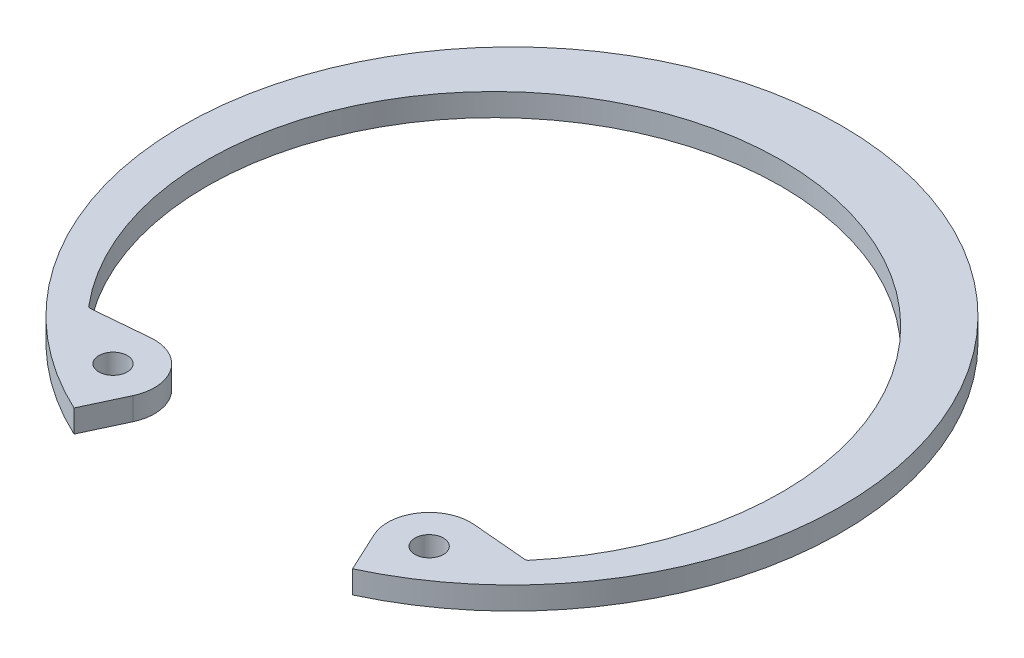
ISO-10303-21;
HEADER;
FILE_DESCRIPTION(('STEP AP214'),'2;1');
FILE_NAME('part.step','',(''),(''),'','','');
FILE_SCHEMA(('AUTOMOTIVE_DESIGN { 1 0 10303 214 1 1 1 1 }'));
ENDSEC;
DATA;
#1=APPLICATION_CONTEXT('core data for automotive mechanical design processes');
#2=APPLICATION_PROTOCOL_DEFINITION('international standard','automotive_design',2000,#1);
#3=PRODUCT_CONTEXT('',#1,'mechanical');
#4=PRODUCT('Part','Part','',(#3));
#5=PRODUCT_RELATED_PRODUCT_CATEGORY('part','',(#4));
#6=PRODUCT_DEFINITION_FORMATION('','',#4);
#7=PRODUCT_DEFINITION_CONTEXT('part definition',#1,'design');
#8=PRODUCT_DEFINITION('design','',#6,#7);
#9=PRODUCT_DEFINITION_SHAPE('','',#8);
#10=(LENGTH_UNIT() NAMED_UNIT(*) SI_UNIT(.MILLI.,.METRE.));
#11=(NAMED_UNIT(*) PLANE_ANGLE_UNIT() SI_UNIT($,.RADIAN.));
#12=(NAMED_UNIT(*) SI_UNIT($,.STERADIAN.) SOLID_ANGLE_UNIT());
#13=UNCERTAINTY_MEASURE_WITH_UNIT(LENGTH_MEASURE(1.E-05),#10,'distance_accuracy_value','');
#14=(GEOMETRIC_REPRESENTATION_CONTEXT(3) GLOBAL_UNCERTAINTY_ASSIGNED_CONTEXT((#13)) GLOBAL_UNIT_ASSIGNED_CONTEXT((#10,
#11,#12)) REPRESENTATION_CONTEXT('',''));
#15=CARTESIAN_POINT('',(0.,0.,0.));
#16=DIRECTION('',(0.,0.,1.));
#17=DIRECTION('',(1.,0.,0.));
#18=AXIS2_PLACEMENT_3D('',#15,#16,#17);
#19=CARTESIAN_POINT('',(10.9888036399848,-1.5748,16.744042909998));
#20=DIRECTION('',(0.,1.,0.));
#21=DIRECTION('',(0.,0.,1.));
#22=AXIS2_PLACEMENT_3D('',#19,#20,#21);
#23=CYLINDRICAL_SURFACE('',#22,2.8829);
#24=CARTESIAN_POINT('',(10.9888036399848,0.,16.744042909998));
#25=DIRECTION('',(0.,1.,0.));
#26=DIRECTION('',(0.,0.,-1.));
#27=AXIS2_PLACEMENT_3D('',#24,#25,#26);
#28=CIRCLE('',#27,2.8829);
#29=CARTESIAN_POINT('',(11.2400649307521,0.,13.8721132148694));
#30=VERTEX_POINT('',#29);
#31=CARTESIAN_POINT('',(8.37600892073687,0.,17.9624090967703));
#32=VERTEX_POINT('',#31);
#33=EDGE_CURVE('E156',#30,#32,#28,.T.);
#34=ORIENTED_EDGE('',*,*,#33,.F.);
#35=DIRECTION('',(0.,1.,0.));
#36=VECTOR('',#35,1.);
#37=CARTESIAN_POINT('',(11.2400649307521,-1.5748,13.8721132148694));
#38=LINE('',#37,#36);
#39=CARTESIAN_POINT('',(11.2400649307521,-1.5748,13.8721132148694));
#40=VERTEX_POINT('',#39);
#41=EDGE_CURVE('E133',#40,#30,#38,.T.);
#42=ORIENTED_EDGE('',*,*,#41,.F.);
#43=CARTESIAN_POINT('',(10.9888036399848,-1.5748,16.744042909998));
#44=DIRECTION('',(0.,1.,0.));
#45=DIRECTION('',(0.,0.,-1.));
#46=AXIS2_PLACEMENT_3D('',#43,#44,#45);
#47=CIRCLE('',#46,2.8829);
#48=CARTESIAN_POINT('',(8.37600892073687,-1.5748,17.9624090967703));
#49=VERTEX_POINT('',#48);
#50=EDGE_CURVE('E126',#40,#49,#47,.T.);
#51=ORIENTED_EDGE('',*,*,#50,.T.);
#52=DIRECTION('',(0.,1.,0.));
#53=VECTOR('',#52,1.);
#54=CARTESIAN_POINT('',(8.37600892073687,-1.5748,17.9624090967703));
#55=LINE('',#54,#53);
#56=EDGE_CURVE('E109',#49,#32,#55,.T.);
#57=ORIENTED_EDGE('',*,*,#56,.T.);
#58=EDGE_LOOP('',(#34,#42,#51,#57));
#59=FACE_BOUND('',#58,.T.);
#60=ADVANCED_FACE('F34',(#59),#23,.T.);
#61=CARTESIAN_POINT('',(15.2181746807127,-1.5748,14.2201527202529));
#62=DIRECTION('',(0.0871557427476615,0.,-0.996194698091745));
#63=DIRECTION('',(-0.996194698091745,0.,-0.0871557427476615));
#64=AXIS2_PLACEMENT_3D('',#61,#62,#63);
#65=PLANE('',#64);
#66=DIRECTION('',(-0.996194698091745,0.,-0.0871557427476615));
#67=VECTOR('',#66,1.);
#68=CARTESIAN_POINT('',(15.2181746807127,0.,14.2201527202529));
#69=LINE('',#68,#67);
#70=CARTESIAN_POINT('',(15.0871573079693,0.,14.2086901854129));
#71=VERTEX_POINT('',#70);
#72=EDGE_CURVE('E134',#71,#30,#69,.T.);
#73=ORIENTED_EDGE('',*,*,#72,.F.);
#74=DIRECTION('',(0.,-1.,0.));
#75=VECTOR('',#74,1.);
#76=CARTESIAN_POINT('',(15.0871573079693,-1.5748,14.2086901854129));
#77=LINE('',#76,#75);
#78=CARTESIAN_POINT('',(15.0871573079693,-1.5748,14.2086901854129));
#79=VERTEX_POINT('',#78);
#80=EDGE_CURVE('E49',#71,#79,#77,.T.);
#81=ORIENTED_EDGE('',*,*,#80,.T.);
#82=DIRECTION('',(-0.996194698091745,0.,-0.0871557427476615));
#83=VECTOR('',#82,1.);
#84=CARTESIAN_POINT('',(15.2181746807127,-1.5748,14.2201527202529));
#85=LINE('',#84,#83);
#86=EDGE_CURVE('E120',#79,#40,#85,.T.);
#87=ORIENTED_EDGE('',*,*,#86,.T.);
#88=ORIENTED_EDGE('',*,*,#41,.T.);
#89=EDGE_LOOP('',(#73,#81,#87,#88));
#90=FACE_BOUND('',#89,.T.);
#91=ADVANCED_FACE('F211',(#90),#65,.T.);
#92=CARTESIAN_POINT('',(0.,-1.5748,1.25014680806619));
#93=DIRECTION('',(0.,1.,0.));
#94=DIRECTION('',(0.,0.,1.));
#95=AXIS2_PLACEMENT_3D('',#92,#93,#94);
#96=CYLINDRICAL_SURFACE('',#95,19.9953468080662);
#97=CARTESIAN_POINT('',(0.,0.,1.25014680806619));
#98=DIRECTION('',(0.,-1.,0.));
#99=DIRECTION('',(0.,0.,1.));
#100=AXIS2_PLACEMENT_3D('',#97,#98,#99);
#101=CIRCLE('',#100,19.9953468080662);
#102=CARTESIAN_POINT('',(-15.3036970486786,0.,14.1191308634261));
#103=VERTEX_POINT('',#102);
#104=CARTESIAN_POINT('',(15.3036970486787,0.,14.1191308634261));
#105=VERTEX_POINT('',#104);
#106=EDGE_CURVE('E136',#103,#105,#101,.T.);
#107=ORIENTED_EDGE('',*,*,#106,.F.);
#108=DIRECTION('',(0.,1.,0.));
#109=VECTOR('',#108,1.);
#110=CARTESIAN_POINT('',(-15.3036970486786,-1.5748,14.1191308634261));
#111=LINE('',#110,#109);
#112=CARTESIAN_POINT('',(-15.3036970486786,-1.5748,14.1191308634261));
#113=VERTEX_POINT('',#112);
#114=EDGE_CURVE('E187',#103,#113,#111,.F.);
#115=ORIENTED_EDGE('',*,*,#114,.T.);
#116=CARTESIAN_POINT('',(0.,-1.5748,1.25014680806619));
#117=DIRECTION('',(0.,-1.,0.));
#118=DIRECTION('',(0.,0.,1.));
#119=AXIS2_PLACEMENT_3D('',#116,#117,#118);
#120=CIRCLE('',#119,19.9953468080662);
#121=CARTESIAN_POINT('',(15.3036970486787,-1.5748,14.1191308634261));
#122=VERTEX_POINT('',#121);
#123=EDGE_CURVE('E152',#113,#122,#120,.T.);
#124=ORIENTED_EDGE('',*,*,#123,.T.);
#125=DIRECTION('',(0.,1.,0.));
#126=VECTOR('',#125,1.);
#127=CARTESIAN_POINT('',(15.3036970486787,-1.5748,14.1191308634261));
#128=LINE('',#127,#126);
#129=EDGE_CURVE('E184',#122,#105,#128,.T.);
#130=ORIENTED_EDGE('',*,*,#129,.T.);
#131=EDGE_LOOP('',(#107,#115,#124,#130));
#132=FACE_BOUND('',#131,.T.);
#133=ADVANCED_FACE('F207',(#132),#96,.F.);
#134=CARTESIAN_POINT('',(-15.2181746807127,-1.5748,14.2201527202528));
#135=DIRECTION('',(-0.0871557427476554,0.,-0.996194698091746));
#136=DIRECTION('',(-0.996194698091746,0.,0.0871557427476554));
#137=AXIS2_PLACEMENT_3D('',#134,#135,#136);
#138=PLANE('',#137);
#139=DIRECTION('',(-0.996194698091746,0.,0.0871557427476554));
#140=VECTOR('',#139,1.);
#141=CARTESIAN_POINT('',(-15.2181746807127,-1.5748,14.2201527202528));
#142=LINE('',#141,#140);
#143=CARTESIAN_POINT('',(-11.240064930752,-1.5748,13.8721132148694));
#144=VERTEX_POINT('',#143);
#145=CARTESIAN_POINT('',(-15.0871573079692,-1.5748,14.2086901854128));
#146=VERTEX_POINT('',#145);
#147=EDGE_CURVE('E149',#144,#146,#142,.T.);
#148=ORIENTED_EDGE('',*,*,#147,.T.);
#149=DIRECTION('',(0.,-1.,0.));
#150=VECTOR('',#149,1.);
#151=CARTESIAN_POINT('',(-15.0871573079692,0.,14.2086901854128));
#152=LINE('',#151,#150);
#153=CARTESIAN_POINT('',(-15.0871573079692,0.,14.2086901854128));
#154=VERTEX_POINT('',#153);
#155=EDGE_CURVE('E174',#146,#154,#152,.F.);
#156=ORIENTED_EDGE('',*,*,#155,.T.);
#157=DIRECTION('',(-0.996194698091746,0.,0.0871557427476554));
#158=VECTOR('',#157,1.);
#159=CARTESIAN_POINT('',(-15.2181746807127,0.,14.2201527202528));
#160=LINE('',#159,#158);
#161=CARTESIAN_POINT('',(-11.240064930752,0.,13.8721132148694));
#162=VERTEX_POINT('',#161);
#163=EDGE_CURVE('E169',#162,#154,#160,.T.);
#164=ORIENTED_EDGE('',*,*,#163,.F.);
#165=DIRECTION('',(0.,1.,0.));
#166=VECTOR('',#165,1.);
#167=CARTESIAN_POINT('',(-11.240064930752,-1.5748,13.8721132148694));
#168=LINE('',#167,#166);
#169=EDGE_CURVE('E175',#144,#162,#168,.T.);
#170=ORIENTED_EDGE('',*,*,#169,.F.);
#171=EDGE_LOOP('',(#148,#156,#164,#170));
#172=FACE_BOUND('',#171,.T.);
#173=ADVANCED_FACE('F201',(#172),#138,.T.);
#174=CARTESIAN_POINT('',(-10.9888036399848,-1.5748,16.744042909998));
#175=DIRECTION('',(0.,1.,0.));
#176=DIRECTION('',(0.,0.,1.));
#177=AXIS2_PLACEMENT_3D('',#174,#175,#176);
#178=CYLINDRICAL_SURFACE('',#177,2.8829);
#179=CARTESIAN_POINT('',(-10.9888036399848,0.,16.744042909998));
#180=DIRECTION('',(0.,1.,0.));
#181=DIRECTION('',(0.,0.,1.));
#182=AXIS2_PLACEMENT_3D('',#179,#180,#181);
#183=CIRCLE('',#182,2.8829);
#184=CARTESIAN_POINT('',(-8.37600892073687,0.,17.9624090967703));
#185=VERTEX_POINT('',#184);
#186=EDGE_CURVE('E166',#185,#162,#183,.T.);
#187=ORIENTED_EDGE('',*,*,#186,.F.);
#188=DIRECTION('',(0.,1.,0.));
#189=VECTOR('',#188,1.);
#190=CARTESIAN_POINT('',(-8.37600892073687,-1.5748,17.9624090967703));
#191=LINE('',#190,#189);
#192=CARTESIAN_POINT('',(-8.37600892073687,-1.5748,17.9624090967703));
#193=VERTEX_POINT('',#192);
#194=EDGE_CURVE('E177',#193,#185,#191,.T.);
#195=ORIENTED_EDGE('',*,*,#194,.F.);
#196=CARTESIAN_POINT('',(-10.9888036399848,-1.5748,16.744042909998));
#197=DIRECTION('',(0.,1.,0.));
#198=DIRECTION('',(0.,0.,1.));
#199=AXIS2_PLACEMENT_3D('',#196,#197,#198);
#200=CIRCLE('',#199,2.8829);
#201=EDGE_CURVE('E146',#193,#144,#200,.T.);
#202=ORIENTED_EDGE('',*,*,#201,.T.);
#203=ORIENTED_EDGE('',*,*,#169,.T.);
#204=EDGE_LOOP('',(#187,#195,#202,#203));
#205=FACE_BOUND('',#204,.T.);
#206=ADVANCED_FACE('F220',(#205),#178,.T.);
#207=CARTESIAN_POINT('',(-9.68252247108869,-1.5748,20.7642364472393));
#208=DIRECTION('',(0.906307787036652,0.,0.422618261740694));
#209=DIRECTION('',(0.422618261740694,0.,-0.906307787036652));
#210=AXIS2_PLACEMENT_3D('',#207,#208,#209);
#211=PLANE('',#210);
#212=DIRECTION('',(0.422618261740694,0.,-0.906307787036653));
#213=VECTOR('',#212,1.);
#214=CARTESIAN_POINT('',(-9.68252247108869,0.,20.7642364472393));
#215=LINE('',#214,#213);
#216=CARTESIAN_POINT('',(-9.6825224710887,0.,20.7642364472393));
#217=VERTEX_POINT('',#216);
#218=EDGE_CURVE('E163',#217,#185,#215,.T.);
#219=ORIENTED_EDGE('',*,*,#218,.F.);
#220=DIRECTION('',(0.,1.,0.));
#221=VECTOR('',#220,1.);
#222=CARTESIAN_POINT('',(-9.6825224710887,-1.5748,20.7642364472393));
#223=LINE('',#222,#221);
#224=CARTESIAN_POINT('',(-9.6825224710887,-1.5748,20.7642364472393));
#225=VERTEX_POINT('',#224);
#226=EDGE_CURVE('E179',#225,#217,#223,.T.);
#227=ORIENTED_EDGE('',*,*,#226,.F.);
#228=DIRECTION('',(0.422618261740694,0.,-0.906307787036653));
#229=VECTOR('',#228,1.);
#230=CARTESIAN_POINT('',(-9.68252247108869,-1.5748,20.7642364472393));
#231=LINE('',#230,#229);
#232=EDGE_CURVE('E143',#225,#193,#231,.T.);
#233=ORIENTED_EDGE('',*,*,#232,.T.);
#234=ORIENTED_EDGE('',*,*,#194,.T.);
#235=EDGE_LOOP('',(#219,#227,#233,#234));
#236=FACE_BOUND('',#235,.T.);
#237=ADVANCED_FACE('F217',(#236),#211,.T.);
#238=CARTESIAN_POINT('',(0.,-1.5748,0.));
#239=DIRECTION('',(0.,1.,0.));
#240=DIRECTION('',(0.,0.,1.));
#241=AXIS2_PLACEMENT_3D('',#238,#239,#240);
#242=CYLINDRICAL_SURFACE('',#241,22.9108);
#243=CARTESIAN_POINT('',(0.,0.,0.));
#244=DIRECTION('',(0.,1.,0.));
#245=DIRECTION('',(0.,0.,1.));
#246=AXIS2_PLACEMENT_3D('',#243,#244,#245);
#247=CIRCLE('',#246,22.9108);
#248=CARTESIAN_POINT('',(9.68252247108869,0.,20.7642364472393));
#249=VERTEX_POINT('',#248);
#250=EDGE_CURVE('E160',#249,#217,#247,.T.);
#251=ORIENTED_EDGE('',*,*,#250,.F.);
#252=DIRECTION('',(0.,1.,0.));
#253=VECTOR('',#252,1.);
#254=CARTESIAN_POINT('',(9.68252247108869,-1.5748,20.7642364472393));
#255=LINE('',#254,#253);
#256=CARTESIAN_POINT('',(9.68252247108869,-1.5748,20.7642364472393));
#257=VERTEX_POINT('',#256);
#258=EDGE_CURVE('E119',#257,#249,#255,.T.);
#259=ORIENTED_EDGE('',*,*,#258,.F.);
#260=CARTESIAN_POINT('',(0.,-1.5748,0.));
#261=DIRECTION('',(0.,1.,0.));
#262=DIRECTION('',(0.,0.,1.));
#263=AXIS2_PLACEMENT_3D('',#260,#261,#262);
#264=CIRCLE('',#263,22.9108);
#265=EDGE_CURVE('E129',#257,#225,#264,.T.);
#266=ORIENTED_EDGE('',*,*,#265,.T.);
#267=ORIENTED_EDGE('',*,*,#226,.T.);
#268=EDGE_LOOP('',(#251,#259,#266,#267));
#269=FACE_BOUND('',#268,.T.);
#270=ADVANCED_FACE('F215',(#269),#242,.T.);
#271=CARTESIAN_POINT('',(9.68252247108869,-1.5748,20.7642364472393));
#272=DIRECTION('',(-0.906307787036652,0.,0.422618261740694));
#273=DIRECTION('',(0.422618261740694,0.,0.906307787036652));
#274=AXIS2_PLACEMENT_3D('',#271,#272,#273);
#275=PLANE('',#274);
#276=DIRECTION('',(0.422618261740694,0.,0.906307787036653));
#277=VECTOR('',#276,1.);
#278=CARTESIAN_POINT('',(9.68252247108869,0.,20.7642364472393));
#279=LINE('',#278,#277);
#280=EDGE_CURVE('E114',#32,#249,#279,.T.);
#281=ORIENTED_EDGE('',*,*,#280,.F.);
#282=ORIENTED_EDGE('',*,*,#56,.F.);
#283=DIRECTION('',(0.422618261740694,0.,0.906307787036653));
#284=VECTOR('',#283,1.);
#285=CARTESIAN_POINT('',(9.68252247108869,-1.5748,20.7642364472393));
#286=LINE('',#285,#284);
#287=EDGE_CURVE('E112',#49,#257,#286,.T.);
#288=ORIENTED_EDGE('',*,*,#287,.T.);
#289=ORIENTED_EDGE('',*,*,#258,.T.);
#290=EDGE_LOOP('',(#281,#282,#288,#289));
#291=FACE_BOUND('',#290,.T.);
#292=ADVANCED_FACE('F111',(#291),#275,.T.);
#293=CARTESIAN_POINT('',(10.9888036399848,-1.5748,16.744042909998));
#294=DIRECTION('',(0.,-1.,0.));
#295=DIRECTION('',(0.,0.,-1.));
#296=AXIS2_PLACEMENT_3D('',#293,#294,#295);
#297=PLANE('',#296);
#298=CARTESIAN_POINT('',(-10.9888036399848,-1.5748,16.744042909998));
#299=DIRECTION('',(0.,1.,0.));
#300=DIRECTION('',(0.,0.,1.));
#301=AXIS2_PLACEMENT_3D('',#298,#299,#300);
#302=CIRCLE('',#301,0.990599999999999);
#303=CARTESIAN_POINT('',(-10.9888036399848,-1.5748,17.734642909998));
#304=VERTEX_POINT('',#303);
#305=EDGE_CURVE('E359',#304,#304,#302,.T.);
#306=ORIENTED_EDGE('',*,*,#305,.T.);
#307=EDGE_LOOP('',(#306));
#308=FACE_BOUND('',#307,.T.);
#309=CARTESIAN_POINT('',(10.9888036399848,-1.5748,16.7440429099981));
#310=DIRECTION('',(0.,1.,0.));
#311=DIRECTION('',(0.,0.,1.));
#312=AXIS2_PLACEMENT_3D('',#309,#310,#311);
#313=CIRCLE('',#312,0.990599999999999);
#314=CARTESIAN_POINT('',(10.9888036399848,-1.5748,17.734642909998));
#315=VERTEX_POINT('',#314);
#316=EDGE_CURVE('E158',#315,#315,#313,.T.);
#317=ORIENTED_EDGE('',*,*,#316,.T.);
#318=EDGE_LOOP('',(#317));
#319=FACE_BOUND('',#318,.T.);
#320=ORIENTED_EDGE('',*,*,#50,.F.);
#321=ORIENTED_EDGE('',*,*,#86,.F.);
#322=CARTESIAN_POINT('',(15.1092948666272,-1.5748,13.9556567320976));
#323=DIRECTION('',(0.,-1.,0.));
#324=DIRECTION('',(0.,0.,-1.));
#325=AXIS2_PLACEMENT_3D('',#322,#323,#324);
#326=CIRCLE('',#325,0.254);
#327=EDGE_CURVE('E11',#79,#122,#326,.F.);
#328=ORIENTED_EDGE('',*,*,#327,.T.);
#329=ORIENTED_EDGE('',*,*,#123,.F.);
#330=CARTESIAN_POINT('',(-15.1092948666271,-1.5748,13.9556567320975));
#331=DIRECTION('',(0.,-1.,0.));
#332=DIRECTION('',(0.,0.,-1.));
#333=AXIS2_PLACEMENT_3D('',#330,#331,#332);
#334=CIRCLE('',#333,0.254);
#335=EDGE_CURVE('E192',#113,#146,#334,.F.);
#336=ORIENTED_EDGE('',*,*,#335,.T.);
#337=ORIENTED_EDGE('',*,*,#147,.F.);
#338=ORIENTED_EDGE('',*,*,#201,.F.);
#339=ORIENTED_EDGE('',*,*,#232,.F.);
#340=ORIENTED_EDGE('',*,*,#265,.F.);
#341=ORIENTED_EDGE('',*,*,#287,.F.);
#342=EDGE_LOOP('',(#320,#321,#328,#329,#336,#337,#338,#339,#340,#341));
#343=FACE_BOUND('',#342,.T.);
#344=ADVANCED_FACE('F125',(#308,#319,#343),#297,.T.);
#345=CARTESIAN_POINT('',(10.9888036399848,0.,16.744042909998));
#346=DIRECTION('',(0.,-1.,0.));
#347=DIRECTION('',(0.,0.,-1.));
#348=AXIS2_PLACEMENT_3D('',#345,#346,#347);
#349=PLANE('',#348);
#350=CARTESIAN_POINT('',(-10.9888036399848,0.,16.744042909998));
#351=DIRECTION('',(0.,1.,0.));
#352=DIRECTION('',(0.,0.,1.));
#353=AXIS2_PLACEMENT_3D('',#350,#351,#352);
#354=CIRCLE('',#353,0.990599999999999);
#355=CARTESIAN_POINT('',(-10.9888036399848,0.,17.734642909998));
#356=VERTEX_POINT('',#355);
#357=EDGE_CURVE('E355',#356,#356,#354,.T.);
#358=ORIENTED_EDGE('',*,*,#357,.F.);
#359=EDGE_LOOP('',(#358));
#360=FACE_BOUND('',#359,.T.);
#361=CARTESIAN_POINT('',(10.9888036399848,0.,16.7440429099981));
#362=DIRECTION('',(0.,1.,0.));
#363=DIRECTION('',(0.,0.,1.));
#364=AXIS2_PLACEMENT_3D('',#361,#362,#363);
#365=CIRCLE('',#364,0.990599999999999);
#366=CARTESIAN_POINT('',(10.9888036399848,0.,17.734642909998));
#367=VERTEX_POINT('',#366);
#368=EDGE_CURVE('E139',#367,#367,#365,.T.);
#369=ORIENTED_EDGE('',*,*,#368,.F.);
#370=EDGE_LOOP('',(#369));
#371=FACE_BOUND('',#370,.T.);
#372=ORIENTED_EDGE('',*,*,#33,.T.);
#373=ORIENTED_EDGE('',*,*,#280,.T.);
#374=ORIENTED_EDGE('',*,*,#250,.T.);
#375=ORIENTED_EDGE('',*,*,#218,.T.);
#376=ORIENTED_EDGE('',*,*,#186,.T.);
#377=ORIENTED_EDGE('',*,*,#163,.T.);
#378=CARTESIAN_POINT('',(-15.1092948666271,0.,13.9556567320975));
#379=DIRECTION('',(0.,-1.,0.));
#380=DIRECTION('',(0.,0.,-1.));
#381=AXIS2_PLACEMENT_3D('',#378,#379,#380);
#382=CIRCLE('',#381,0.254);
#383=EDGE_CURVE('E190',#154,#103,#382,.T.);
#384=ORIENTED_EDGE('',*,*,#383,.T.);
#385=ORIENTED_EDGE('',*,*,#106,.T.);
#386=CARTESIAN_POINT('',(15.1092948666272,0.,13.9556567320976));
#387=DIRECTION('',(0.,-1.,0.));
#388=DIRECTION('',(0.,0.,-1.));
#389=AXIS2_PLACEMENT_3D('',#386,#387,#388);
#390=CIRCLE('',#389,0.254);
#391=EDGE_CURVE('E42',#105,#71,#390,.T.);
#392=ORIENTED_EDGE('',*,*,#391,.T.);
#393=ORIENTED_EDGE('',*,*,#72,.T.);
#394=EDGE_LOOP('',(#372,#373,#374,#375,#376,#377,#384,#385,#392,#393));
#395=FACE_BOUND('',#394,.T.);
#396=ADVANCED_FACE('F205',(#360,#371,#395),#349,.F.);
#397=CARTESIAN_POINT('',(10.9888036399848,-1.5748,16.7440429099981));
#398=DIRECTION('',(0.,1.,0.));
#399=DIRECTION('',(0.,0.,1.));
#400=AXIS2_PLACEMENT_3D('',#397,#398,#399);
#401=CYLINDRICAL_SURFACE('',#400,0.990599999999999);
#402=ORIENTED_EDGE('',*,*,#316,.F.);
#403=EDGE_LOOP('',(#402));
#404=FACE_BOUND('',#403,.T.);
#405=ORIENTED_EDGE('',*,*,#368,.T.);
#406=EDGE_LOOP('',(#405));
#407=FACE_BOUND('',#406,.T.);
#408=ADVANCED_FACE('F243',(#404,#407),#401,.F.);
#409=CARTESIAN_POINT('',(-10.9888036399848,-1.5748,16.744042909998));
#410=DIRECTION('',(0.,1.,0.));
#411=DIRECTION('',(0.,0.,1.));
#412=AXIS2_PLACEMENT_3D('',#409,#410,#411);
#413=CYLINDRICAL_SURFACE('',#412,0.990599999999999);
#414=ORIENTED_EDGE('',*,*,#305,.F.);
#415=EDGE_LOOP('',(#414));
#416=FACE_BOUND('',#415,.T.);
#417=ORIENTED_EDGE('',*,*,#357,.T.);
#418=EDGE_LOOP('',(#417));
#419=FACE_BOUND('',#418,.T.);
#420=ADVANCED_FACE('F238',(#416,#419),#413,.F.);
#421=CARTESIAN_POINT('',(-15.1092948666271,-1.5748,13.9556567320975));
#422=DIRECTION('',(0.,1.,0.));
#423=DIRECTION('',(0.,0.,1.));
#424=AXIS2_PLACEMENT_3D('',#421,#422,#423);
#425=CYLINDRICAL_SURFACE('',#424,0.254);
#426=ORIENTED_EDGE('',*,*,#335,.F.);
#427=ORIENTED_EDGE('',*,*,#114,.F.);
#428=ORIENTED_EDGE('',*,*,#383,.F.);
#429=ORIENTED_EDGE('',*,*,#155,.F.);
#430=EDGE_LOOP('',(#426,#427,#428,#429));
#431=FACE_BOUND('',#430,.T.);
#432=ADVANCED_FACE('F203',(#431),#425,.F.);
#433=CARTESIAN_POINT('',(15.1092948666272,-1.5748,13.9556567320976));
#434=DIRECTION('',(0.,1.,0.));
#435=DIRECTION('',(0.,0.,1.));
#436=AXIS2_PLACEMENT_3D('',#433,#434,#435);
#437=CYLINDRICAL_SURFACE('',#436,0.254);
#438=ORIENTED_EDGE('',*,*,#327,.F.);
#439=ORIENTED_EDGE('',*,*,#80,.F.);
#440=ORIENTED_EDGE('',*,*,#391,.F.);
#441=ORIENTED_EDGE('',*,*,#129,.F.);
#442=EDGE_LOOP('',(#438,#439,#440,#441));
#443=FACE_BOUND('',#442,.T.);
#444=ADVANCED_FACE('F36',(#443),#437,.F.);
#445=CLOSED_SHELL('',(#60,#91,#133,#173,#206,#237,#270,#292,#344,#396,#408,#420,#432,#444));
#446=MANIFOLD_SOLID_BREP('B2',#445);
#447=ADVANCED_BREP_SHAPE_REPRESENTATION('',(#18,#446),#14);
#448=SHAPE_DEFINITION_REPRESENTATION(#9,#447);
ENDSEC;
END-ISO-10303-21;
